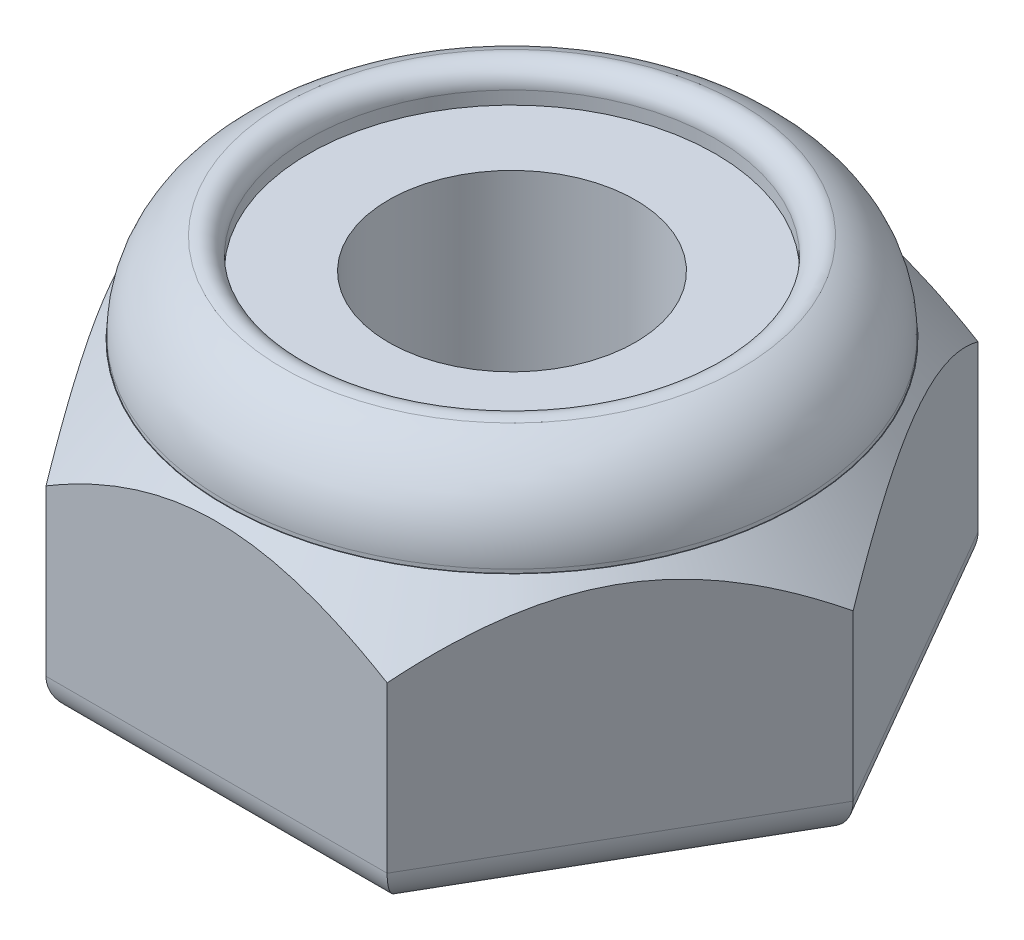
ISO-10303-21;
HEADER;
FILE_DESCRIPTION(('STEP AP214'),'2;1');
FILE_NAME('part.step','',(''),(''),'','','');
FILE_SCHEMA(('AUTOMOTIVE_DESIGN { 1 0 10303 214 1 1 1 1 }'));
ENDSEC;
DATA;
#1=APPLICATION_CONTEXT('core data for automotive mechanical design processes');
#2=APPLICATION_PROTOCOL_DEFINITION('international standard','automotive_design',2000,#1);
#3=PRODUCT_CONTEXT('',#1,'mechanical');
#4=PRODUCT('Part','Part','',(#3));
#5=PRODUCT_RELATED_PRODUCT_CATEGORY('part','',(#4));
#6=PRODUCT_DEFINITION_FORMATION('','',#4);
#7=PRODUCT_DEFINITION_CONTEXT('part definition',#1,'design');
#8=PRODUCT_DEFINITION('design','',#6,#7);
#9=PRODUCT_DEFINITION_SHAPE('','',#8);
#10=(LENGTH_UNIT() NAMED_UNIT(*) SI_UNIT(.MILLI.,.METRE.));
#11=(NAMED_UNIT(*) PLANE_ANGLE_UNIT() SI_UNIT($,.RADIAN.));
#12=(NAMED_UNIT(*) SI_UNIT($,.STERADIAN.) SOLID_ANGLE_UNIT());
#13=UNCERTAINTY_MEASURE_WITH_UNIT(LENGTH_MEASURE(1.E-05),#10,'distance_accuracy_value','');
#14=(GEOMETRIC_REPRESENTATION_CONTEXT(3) GLOBAL_UNCERTAINTY_ASSIGNED_CONTEXT((#13)) GLOBAL_UNIT_ASSIGNED_CONTEXT((#10,
#11,#12)) REPRESENTATION_CONTEXT('',''));
#15=CARTESIAN_POINT('',(0.,0.,0.));
#16=DIRECTION('',(0.,0.,1.));
#17=DIRECTION('',(1.,0.,0.));
#18=AXIS2_PLACEMENT_3D('',#15,#16,#17);
#19=CARTESIAN_POINT('',(0.,4.9784,0.));
#20=DIRECTION('',(0.,-1.,0.));
#21=DIRECTION('',(0.,0.,-1.));
#22=AXIS2_PLACEMENT_3D('',#19,#20,#21);
#23=CYLINDRICAL_SURFACE('',#22,3.937);
#24=CARTESIAN_POINT('',(0.,3.7084,0.));
#25=DIRECTION('',(0.,1.,0.));
#26=DIRECTION('',(0.,0.,1.));
#27=AXIS2_PLACEMENT_3D('',#24,#25,#26);
#28=CIRCLE('',#27,3.937);
#29=CARTESIAN_POINT('',(0.,3.7084,3.937));
#30=VERTEX_POINT('',#29);
#31=EDGE_CURVE('E244',#30,#30,#28,.T.);
#32=ORIENTED_EDGE('',*,*,#31,.F.);
#33=EDGE_LOOP('',(#32));
#34=FACE_BOUND('',#33,.T.);
#35=CARTESIAN_POINT('',(0.,3.6576,0.));
#36=DIRECTION('',(0.,-1.,0.));
#37=DIRECTION('',(0.,0.,-1.));
#38=AXIS2_PLACEMENT_3D('',#35,#36,#37);
#39=CIRCLE('',#38,3.937);
#40=CARTESIAN_POINT('',(0.,3.6576,-3.937));
#41=VERTEX_POINT('',#40);
#42=EDGE_CURVE('E20',#41,#41,#39,.F.);
#43=ORIENTED_EDGE('',*,*,#42,.T.);
#44=EDGE_LOOP('',(#43));
#45=FACE_BOUND('',#44,.T.);
#46=ADVANCED_FACE('F17',(#34,#45),#23,.T.);
#47=CARTESIAN_POINT('',(0.,3.7084,0.));
#48=DIRECTION('',(0.,1.,0.));
#49=DIRECTION('',(0.,0.,1.));
#50=AXIS2_PLACEMENT_3D('',#47,#48,#49);
#51=TOROIDAL_SURFACE('',#50,2.667,1.27);
#52=ORIENTED_EDGE('',*,*,#31,.T.);
#53=EDGE_LOOP('',(#52));
#54=FACE_BOUND('',#53,.T.);
#55=CARTESIAN_POINT('',(0.,4.88572150982644,0.));
#56=DIRECTION('',(0.,-1.,0.));
#57=DIRECTION('',(0.,0.,-1.));
#58=AXIS2_PLACEMENT_3D('',#55,#56,#57);
#59=CIRCLE('',#58,3.14325);
#60=CARTESIAN_POINT('',(0.,4.88572150982644,-3.14325));
#61=VERTEX_POINT('',#60);
#62=EDGE_CURVE('E238',#61,#61,#59,.F.);
#63=ORIENTED_EDGE('',*,*,#62,.F.);
#64=EDGE_LOOP('',(#63));
#65=FACE_BOUND('',#64,.T.);
#66=ADVANCED_FACE('F135',(#54,#65),#51,.T.);
#67=CARTESIAN_POINT('',(2.34315,3.6576,4.05845484975502));
#68=DIRECTION('',(0.,-1.,0.));
#69=DIRECTION('',(0.,0.,-1.));
#70=AXIS2_PLACEMENT_3D('',#67,#68,#69);
#71=PLANE('',#70);
#72=ORIENTED_EDGE('',*,*,#42,.F.);
#73=EDGE_LOOP('',(#72));
#74=FACE_BOUND('',#73,.T.);
#75=CARTESIAN_POINT('',(0.,3.65760000011051,0.));
#76=DIRECTION('',(0.,-1.,0.));
#77=DIRECTION('',(0.,0.,-1.));
#78=AXIS2_PLACEMENT_3D('',#75,#76,#77);
#79=CIRCLE('',#78,3.94407100938664);
#80=CARTESIAN_POINT('',(0.,3.65760000011051,-3.94407100938664));
#81=VERTEX_POINT('',#80);
#82=EDGE_CURVE('E120',#81,#81,#79,.T.);
#83=ORIENTED_EDGE('',*,*,#82,.F.);
#84=EDGE_LOOP('',(#83));
#85=FACE_BOUND('',#84,.T.);
#86=ADVANCED_FACE('F130',(#74,#85),#71,.F.);
#87=CARTESIAN_POINT('',(0.,4.65025720786115,0.));
#88=DIRECTION('',(0.,-1.,0.));
#89=DIRECTION('',(0.,0.,-1.));
#90=AXIS2_PLACEMENT_3D('',#87,#88,#89);
#91=TOROIDAL_SURFACE('',#90,3.048,0.254);
#92=CARTESIAN_POINT('',(0.,4.65025720786115,0.));
#93=DIRECTION('',(0.,1.,0.));
#94=DIRECTION('',(0.,0.,1.));
#95=AXIS2_PLACEMENT_3D('',#92,#93,#94);
#96=CIRCLE('',#95,2.794);
#97=CARTESIAN_POINT('',(0.,4.65025720786115,2.794));
#98=VERTEX_POINT('',#97);
#99=EDGE_CURVE('E105',#98,#98,#96,.F.);
#100=ORIENTED_EDGE('',*,*,#99,.T.);
#101=EDGE_LOOP('',(#100));
#102=FACE_BOUND('',#101,.T.);
#103=ORIENTED_EDGE('',*,*,#62,.T.);
#104=EDGE_LOOP('',(#103));
#105=FACE_BOUND('',#104,.T.);
#106=ADVANCED_FACE('F126',(#102,#105),#91,.T.);
#107=CARTESIAN_POINT('',(0.,2.76773860969115,0.));
#108=DIRECTION('',(0.,-1.,0.));
#109=DIRECTION('',(0.,0.,-1.));
#110=AXIS2_PLACEMENT_3D('',#107,#108,#109);
#111=CONICAL_SURFACE('',#110,4.69075337389313,0.698131700802158);
#112=CARTESIAN_POINT('',(-4.68630000001476,2.77304593398821,-5.33338044389321E-11));
#113=CARTESIAN_POINT('',(-4.65177717141793,2.81418235889091,0.0597952931149053));
#114=CARTESIAN_POINT('',(-4.61695780288956,2.85432113110728,0.120104208500933));
#115=CARTESIAN_POINT('',(-4.54666264441453,2.93230661020916,0.241858994511412));
#116=CARTESIAN_POINT('',(-4.51118655194523,2.97015222462005,0.303305389120424));
#117=CARTESIAN_POINT('',(-4.40329561885259,3.08018701500149,0.490177966909937));
#118=CARTESIAN_POINT('',(-4.32983334004397,3.14837015576205,0.617418366247689));
#119=CARTESIAN_POINT('',(-4.1797796499728,3.27092778609509,0.877318981315214));
#120=CARTESIAN_POINT('',(-4.10317943932402,3.32525984886677,1.00999443802899));
#121=CARTESIAN_POINT('',(-3.94747591651277,3.41577217646148,1.27968085045525));
#122=CARTESIAN_POINT('',(-3.86837998243724,3.45200143013375,1.4166790269463));
#123=CARTESIAN_POINT('',(-3.73746585196202,3.49372811243502,1.64342895235813));
#124=CARTESIAN_POINT('',(-3.68614686019516,3.50560413715319,1.73231605349153));
#125=CARTESIAN_POINT('',(-3.58316406708587,3.52008140702852,1.91068748346216));
#126=CARTESIAN_POINT('',(-3.53150020834088,3.5226810675312,2.00017191172355));
#127=CARTESIAN_POINT('',(-3.42855034551142,3.51847006524789,2.17848630477643));
#128=CARTESIAN_POINT('',(-3.3772638088531,3.51171021118306,2.26731719201287));
#129=CARTESIAN_POINT('',(-3.27519197708947,3.48921023555424,2.4441107906491));
#130=CARTESIAN_POINT('',(-3.22440670715057,3.4734696654174,2.53207345845939));
#131=CARTESIAN_POINT('',(-3.10963060134479,3.42817062222156,2.73087150520989));
#132=CARTESIAN_POINT('',(-3.04589899577138,3.39598542076133,2.84125788411099));
#133=CARTESIAN_POINT('',(-2.92018166739655,3.32004827846255,3.05900668424801));
#134=CARTESIAN_POINT('',(-2.85819691962206,3.27629001415058,3.16636741668776));
#135=CARTESIAN_POINT('',(-2.735889068299,3.17910361386979,3.37821082934389));
#136=CARTESIAN_POINT('',(-2.67557364738244,3.12563730731956,3.48268020285126));
#137=CARTESIAN_POINT('',(-2.55683004320588,3.01104764609313,3.68835015835892));
#138=CARTESIAN_POINT('',(-2.49840123089761,2.94992687749399,3.78955182990274));
#139=CARTESIAN_POINT('',(-2.42439626092569,2.86741854625153,3.91773219790672));
#140=CARTESIAN_POINT('',(-2.40802320106583,2.84883596648691,3.94609116945937));
#141=CARTESIAN_POINT('',(-2.3754621576302,2.81125673907332,4.00248855103733));
#142=CARTESIAN_POINT('',(-2.35927376441604,2.79226151161516,4.03052767057717));
#143=CARTESIAN_POINT('',(-2.3431499999717,2.77304593399368,4.05845484980404));
#144=B_SPLINE_CURVE_WITH_KNOTS('',3,(#112,#113,#114,#115,#116,#117,#118,#119,#120,#121,#122,
#123,#124,#125,#126,#127,#128,#129,#130,#131,#132,#133,#134,#135,#136,#137,#138,#139,#140,#141,
#142,#143),.UNSPECIFIED.,.F.,.F.,(4,2,2,2,2,2,2,2,2,2,2,2,2,2,2,4),(0.,0.241096809088565,
0.48230758945251,0.967637153847366,1.45443592242802,1.93991010956963,2.24950193433618,
2.55914664324831,2.86711700071403,3.17510274216898,3.56882084711336,3.96275452403261,
4.35827201930639,4.75365624679115,4.86660838982692,4.97921936905084),.UNSPECIFIED.);
#145=CARTESIAN_POINT('',(-4.68630000002839,2.77304593399358,0.));
#146=VERTEX_POINT('',#145);
#147=CARTESIAN_POINT('',(-2.34315000001419,2.77304593399358,4.05845484977959));
#148=VERTEX_POINT('',#147);
#149=EDGE_CURVE('E92',#146,#148,#144,.T.);
#150=ORIENTED_EDGE('',*,*,#149,.T.);
#151=CARTESIAN_POINT('',(-2.34315000005357,2.77304593398822,4.05845484974113));
#152=CARTESIAN_POINT('',(-2.27415972170409,2.81414935271336,4.05845484974989));
#153=CARTESIAN_POINT('',(-2.20457738522044,2.85425669884705,4.05845484975361));
#154=CARTESIAN_POINT('',(-2.06410193528095,2.93218331968194,4.05845484975642));
#155=CARTESIAN_POINT('',(-1.99320821641151,2.9700015013142,4.05845484975551));
#156=CARTESIAN_POINT('',(-1.77754688772429,3.07999086386455,4.05845484975401));
#157=CARTESIAN_POINT('',(-1.63068545869954,3.1481589403704,4.05845484975469));
#158=CARTESIAN_POINT('',(-1.33052752457963,3.27077676919262,4.05845484975534));
#159=CARTESIAN_POINT('',(-1.17720631609342,3.32516696804196,4.0584548497553));
#160=CARTESIAN_POINT('',(-0.86561350380778,3.41574608766059,4.05845484975473));
#161=CARTESIAN_POINT('',(-0.707359229311903,3.45199244874899,4.0584548497542));
#162=CARTESIAN_POINT('',(-0.456822143345071,3.49192146546895,4.05845484975548));
#163=CARTESIAN_POINT('',(-0.365672921156202,3.50290887295604,4.05845484975637));
#164=CARTESIAN_POINT('',(-0.183016322004482,3.51758027913678,4.05845484975366));
#165=CARTESIAN_POINT('',(-0.0915105175250816,3.52128341037061,4.05845484975007));
#166=CARTESIAN_POINT('',(0.104649468641441,3.52128177491765,4.0584548497495));
#167=CARTESIAN_POINT('',(0.209305100872023,3.51643705333648,4.05845484975354));
#168=CARTESIAN_POINT('',(0.41778718190987,3.49730239560235,4.05845484975649));
#169=CARTESIAN_POINT('',(0.521613181352877,3.48300765111694,4.05845484975541));
#170=CARTESIAN_POINT('',(0.728332544913561,3.44553375886282,4.05845484975462));
#171=CARTESIAN_POINT('',(0.831215331558566,3.42229697724238,4.05845484975491));
#172=CARTESIAN_POINT('',(1.03487580391125,3.36791830054733,4.05845484975512));
#173=CARTESIAN_POINT('',(1.13565289468809,3.33677420321768,4.05845484975504));
#174=CARTESIAN_POINT('',(1.33273383822163,3.26838741918099,4.05845484975499));
#175=CARTESIAN_POINT('',(1.42908716226035,3.23128582684656,4.05845484975501));
#176=CARTESIAN_POINT('',(1.61947291708309,3.15151071591982,4.05845484975502));
#177=CARTESIAN_POINT('',(1.71350470709807,3.10883567899407,4.05845484975502));
#178=CARTESIAN_POINT('',(1.89803195382395,3.01941532331662,4.05845484975501));
#179=CARTESIAN_POINT('',(1.98855798046432,2.97273255726059,4.05845484975502));
#180=CARTESIAN_POINT('',(2.16742834958163,2.87556944084479,4.05845484975502));
#181=CARTESIAN_POINT('',(2.25577492892455,2.82509321932285,4.05845484975502));
#182=CARTESIAN_POINT('',(2.34315000005566,2.77304593399424,4.05845484975502));
#183=B_SPLINE_CURVE_WITH_KNOTS('',3,(#151,#152,#153,#154,#155,#156,#157,#158,#159,#160,#161,
#162,#163,#164,#165,#166,#167,#168,#169,#170,#171,#172,#173,#174,#175,#176,#177,#178,#179,#180,
#181,#182),.UNSPECIFIED.,.F.,.F.,(4,2,2,2,2,2,2,2,2,2,2,2,2,2,2,4),(0.,0.24090330355952,
0.481920744736242,0.967059466968447,1.4542606837498,1.93990959177134,2.21507934695766,
2.4895253838939,2.80337599596431,3.11738642360393,3.43345557972405,3.74961286055439,
4.0591611810716,4.36879400620232,4.67425708545866,4.97939238068026),.UNSPECIFIED.);
#184=CARTESIAN_POINT('',(2.34315000001419,2.77304593399358,4.05845484977959));
#185=VERTEX_POINT('',#184);
#186=EDGE_CURVE('E84',#148,#185,#183,.T.);
#187=ORIENTED_EDGE('',*,*,#186,.T.);
#188=CARTESIAN_POINT('',(2.3431499999612,2.77304593398822,4.05845484979446));
#189=CARTESIAN_POINT('',(2.37767282857321,2.81418235889091,3.99865955663499));
#190=CARTESIAN_POINT('',(2.41249219710801,2.85432113110729,3.93835064125267));
#191=CARTESIAN_POINT('',(2.48278735558791,2.93230661020917,3.816595855245));
#192=CARTESIAN_POINT('',(2.51826344805563,2.97015222462005,3.75514946063508));
#193=CARTESIAN_POINT('',(2.62615438114571,3.0801870150015,3.56827688284408));
#194=CARTESIAN_POINT('',(2.69961665995557,3.14837015576206,3.44103648350706));
#195=CARTESIAN_POINT('',(2.84967035002766,3.2709277860951,3.18113586844006));
#196=CARTESIAN_POINT('',(2.9262705606761,3.32525984886677,3.04846041172609));
#197=CARTESIAN_POINT('',(3.08197408348711,3.41577217646148,2.77877399929969));
#198=CARTESIAN_POINT('',(3.16107001756274,3.45200143013376,2.64177582280869));
#199=CARTESIAN_POINT('',(3.291984148038,3.49372811243503,2.41502589739689));
#200=CARTESIAN_POINT('',(3.34330313980485,3.50560413715319,2.32613879626348));
#201=CARTESIAN_POINT('',(3.44628593291413,3.52008140702853,2.14776736629285));
#202=CARTESIAN_POINT('',(3.49794979165912,3.52268106753121,2.05828293803146));
#203=CARTESIAN_POINT('',(3.60089965448859,3.51847006524789,1.87996854497858));
#204=CARTESIAN_POINT('',(3.6521861911469,3.51171021118306,1.79113765774214));
#205=CARTESIAN_POINT('',(3.75425802291053,3.48921023555425,1.61434405910591));
#206=CARTESIAN_POINT('',(3.80504329284943,3.47346966541741,1.52638139129562));
#207=CARTESIAN_POINT('',(3.91981939865521,3.42817062222156,1.32758334454512));
#208=CARTESIAN_POINT('',(3.98355100422862,3.39598542076133,1.21719696564402));
#209=CARTESIAN_POINT('',(4.10926833260345,3.32004827846255,0.999448165506998));
#210=CARTESIAN_POINT('',(4.17125308037794,3.27629001415058,0.892087433067249));
#211=CARTESIAN_POINT('',(4.293560931701,3.17910361386979,0.680244020411123));
#212=CARTESIAN_POINT('',(4.35387635261756,3.12563730731956,0.575774646903748));
#213=CARTESIAN_POINT('',(4.47261995679412,3.01104764609313,0.370104691396085));
#214=CARTESIAN_POINT('',(4.53104876910239,2.94992687749399,0.268903019852267));
#215=CARTESIAN_POINT('',(4.60505373907431,2.86741854625153,0.140722651848287));
#216=CARTESIAN_POINT('',(4.62142679893417,2.84883596648691,0.112363680295637));
#217=CARTESIAN_POINT('',(4.6539878423698,2.81125673907332,0.0559662987176779));
#218=CARTESIAN_POINT('',(4.67017623558396,2.79226151161516,0.0279271791778418));
#219=CARTESIAN_POINT('',(4.6863000000283,2.77304593399368,-4.90270010654762E-11));
#220=B_SPLINE_CURVE_WITH_KNOTS('',3,(#188,#189,#190,#191,#192,#193,#194,#195,#196,#197,#198,
#199,#200,#201,#202,#203,#204,#205,#206,#207,#208,#209,#210,#211,#212,#213,#214,#215,#216,#217,
#218,#219),.UNSPECIFIED.,.F.,.F.,(4,2,2,2,2,2,2,2,2,2,2,2,2,2,2,4),(0.,0.241096809088565,
0.48230758945251,0.967637153847364,1.45443592242802,1.93991010956962,2.24950193433617,
2.5591466432483,2.86711700071402,3.17510274216897,3.56882084711336,3.9627545240326,
4.35827201930639,4.75365624679114,4.86660838982692,4.97921936905084),.UNSPECIFIED.);
#221=CARTESIAN_POINT('',(4.68630000001419,2.7730459340105,-2.45819040202403E-11));
#222=VERTEX_POINT('',#221);
#223=EDGE_CURVE('E89',#185,#222,#220,.T.);
#224=ORIENTED_EDGE('',*,*,#223,.T.);
#225=CARTESIAN_POINT('',(4.68630000001476,2.77304593398822,5.33267015141622E-11));
#226=CARTESIAN_POINT('',(4.65177717141792,2.81418235889091,-0.0597952931149122));
#227=CARTESIAN_POINT('',(4.61695780288956,2.85432113110729,-0.12010420850094));
#228=CARTESIAN_POINT('',(4.54666264441452,2.93230661020917,-0.241858994511418));
#229=CARTESIAN_POINT('',(4.51118655194522,2.97015222462005,-0.303305389120429));
#230=CARTESIAN_POINT('',(4.40329561885258,3.0801870150015,-0.490177966909942));
#231=CARTESIAN_POINT('',(4.32983334004397,3.14837015576206,-0.617418366247693));
#232=CARTESIAN_POINT('',(4.1797796499728,3.27092778609509,-0.877318981315217));
#233=CARTESIAN_POINT('',(4.10317943932402,3.32525984886677,-1.00999443802899));
#234=CARTESIAN_POINT('',(3.94747591651277,3.41577217646148,-1.27968085045525));
#235=CARTESIAN_POINT('',(3.86837998243724,3.45200143013375,-1.4166790269463));
#236=CARTESIAN_POINT('',(3.73746585196202,3.49372811243502,-1.64342895235813));
#237=CARTESIAN_POINT('',(3.68614686019516,3.50560413715319,-1.73231605349153));
#238=CARTESIAN_POINT('',(3.58316406708587,3.52008140702852,-1.91068748346216));
#239=CARTESIAN_POINT('',(3.53150020834088,3.5226810675312,-2.00017191172355));
#240=CARTESIAN_POINT('',(3.42855034551142,3.51847006524789,-2.17848630477643));
#241=CARTESIAN_POINT('',(3.3772638088531,3.51171021118306,-2.26731719201287));
#242=CARTESIAN_POINT('',(3.27519197708947,3.48921023555424,-2.4441107906491));
#243=CARTESIAN_POINT('',(3.22440670715057,3.4734696654174,-2.53207345845939));
#244=CARTESIAN_POINT('',(3.10963060134479,3.42817062222156,-2.73087150520989));
#245=CARTESIAN_POINT('',(3.04589899577138,3.39598542076133,-2.84125788411098));
#246=CARTESIAN_POINT('',(2.92018166739655,3.32004827846255,-3.05900668424801));
#247=CARTESIAN_POINT('',(2.85819691962206,3.27629001415058,-3.16636741668776));
#248=CARTESIAN_POINT('',(2.735889068299,3.17910361386979,-3.37821082934388));
#249=CARTESIAN_POINT('',(2.67557364738245,3.12563730731956,-3.48268020285126));
#250=CARTESIAN_POINT('',(2.55683004320588,3.01104764609313,-3.68835015835892));
#251=CARTESIAN_POINT('',(2.49840123089761,2.94992687749399,-3.78955182990274));
#252=CARTESIAN_POINT('',(2.42439626092569,2.86741854625153,-3.91773219790672));
#253=CARTESIAN_POINT('',(2.40802320106583,2.84883596648691,-3.94609116945937));
#254=CARTESIAN_POINT('',(2.3754621576302,2.81125673907332,-4.00248855103733));
#255=CARTESIAN_POINT('',(2.35927376441604,2.79226151161516,-4.03052767057717));
#256=CARTESIAN_POINT('',(2.3431499999717,2.77304593399368,-4.05845484980404));
#257=B_SPLINE_CURVE_WITH_KNOTS('',3,(#225,#226,#227,#228,#229,#230,#231,#232,#233,#234,#235,
#236,#237,#238,#239,#240,#241,#242,#243,#244,#245,#246,#247,#248,#249,#250,#251,#252,#253,#254,
#255,#256),.UNSPECIFIED.,.F.,.F.,(4,2,2,2,2,2,2,2,2,2,2,2,2,2,2,4),(0.,0.241096809088563,
0.482307589452507,0.967637153847359,1.45443592242801,1.93991010956962,2.24950193433616,
2.55914664324829,2.86711700071401,3.17510274216897,3.56882084711335,3.96275452403259,
4.35827201930638,4.75365624679114,4.86660838982692,4.97921936905084),.UNSPECIFIED.);
#258=CARTESIAN_POINT('',(2.34315000001419,2.77304593399358,-4.0584548497796));
#259=VERTEX_POINT('',#258);
#260=EDGE_CURVE('E194',#222,#259,#257,.T.);
#261=ORIENTED_EDGE('',*,*,#260,.T.);
#262=CARTESIAN_POINT('',(2.34315000005357,2.77304593398821,-4.05845484974114));
#263=CARTESIAN_POINT('',(2.27415972170409,2.81414935271335,-4.05845484974989));
#264=CARTESIAN_POINT('',(2.20457738522045,2.85425669884704,-4.05845484975361));
#265=CARTESIAN_POINT('',(2.06410193528096,2.93218331968193,-4.05845484975643));
#266=CARTESIAN_POINT('',(1.99320821641151,2.97000150131419,-4.05845484975552));
#267=CARTESIAN_POINT('',(1.77754688772429,3.07999086386454,-4.05845484975402));
#268=CARTESIAN_POINT('',(1.63068545869954,3.1481589403704,-4.0584548497547));
#269=CARTESIAN_POINT('',(1.33052752457963,3.27077676919261,-4.05845484975534));
#270=CARTESIAN_POINT('',(1.17720631609342,3.32516696804195,-4.0584548497553));
#271=CARTESIAN_POINT('',(0.865613503807778,3.41574608766058,-4.05845484975474));
#272=CARTESIAN_POINT('',(0.707359229311901,3.45199244874898,-4.0584548497542));
#273=CARTESIAN_POINT('',(0.456822143345069,3.49192146546895,-4.05845484975548));
#274=CARTESIAN_POINT('',(0.365672921156201,3.50290887295604,-4.05845484975637));
#275=CARTESIAN_POINT('',(0.183016322004481,3.51758027913677,-4.05845484975367));
#276=CARTESIAN_POINT('',(0.0915105175250814,3.5212834103706,-4.05845484975008));
#277=CARTESIAN_POINT('',(-0.104649468641441,3.52128177491764,-4.0584548497495));
#278=CARTESIAN_POINT('',(-0.209305100872023,3.51643705333648,-4.05845484975354));
#279=CARTESIAN_POINT('',(-0.41778718190987,3.49730239560234,-4.0584548497565));
#280=CARTESIAN_POINT('',(-0.521613181352877,3.48300765111693,-4.05845484975542));
#281=CARTESIAN_POINT('',(-0.728332544913562,3.44553375886281,-4.05845484975462));
#282=CARTESIAN_POINT('',(-0.831215331558566,3.42229697724237,-4.05845484975491));
#283=CARTESIAN_POINT('',(-1.03487580391125,3.36791830054732,-4.05845484975513));
#284=CARTESIAN_POINT('',(-1.13565289468809,3.33677420321767,-4.05845484975505));
#285=CARTESIAN_POINT('',(-1.33273383822163,3.26838741918098,-4.05845484975499));
#286=CARTESIAN_POINT('',(-1.42908716226035,3.23128582684655,-4.05845484975501));
#287=CARTESIAN_POINT('',(-1.61947291708309,3.15151071591982,-4.05845484975503));
#288=CARTESIAN_POINT('',(-1.71350470709807,3.10883567899406,-4.05845484975502));
#289=CARTESIAN_POINT('',(-1.89803195382395,3.01941532331662,-4.05845484975502));
#290=CARTESIAN_POINT('',(-1.98855798046431,2.97273255726059,-4.05845484975502));
#291=CARTESIAN_POINT('',(-2.16742834958162,2.87556944084479,-4.05845484975502));
#292=CARTESIAN_POINT('',(-2.25577492892455,2.82509321932284,-4.05845484975502));
#293=CARTESIAN_POINT('',(-2.34315000005566,2.77304593399424,-4.05845484975502));
#294=B_SPLINE_CURVE_WITH_KNOTS('',3,(#262,#263,#264,#265,#266,#267,#268,#269,#270,#271,#272,
#273,#274,#275,#276,#277,#278,#279,#280,#281,#282,#283,#284,#285,#286,#287,#288,#289,#290,#291,
#292,#293),.UNSPECIFIED.,.F.,.F.,(4,2,2,2,2,2,2,2,2,2,2,2,2,2,2,4),(0.,0.24090330355952,
0.481920744736243,0.96705946696845,1.4542606837498,1.93990959177135,2.21507934695766,
2.48952538389391,2.80337599596432,3.11738642360394,3.43345557972405,3.74961286055439,
4.0591611810716,4.36879400620232,4.67425708545866,4.97939238068026),.UNSPECIFIED.);
#295=CARTESIAN_POINT('',(-2.34315000001419,2.77304593399358,-4.0584548497796));
#296=VERTEX_POINT('',#295);
#297=EDGE_CURVE('E204',#259,#296,#294,.T.);
#298=ORIENTED_EDGE('',*,*,#297,.T.);
#299=CARTESIAN_POINT('',(-2.3431499999612,2.77304593398821,-4.05845484979447));
#300=CARTESIAN_POINT('',(-2.37767282857321,2.81418235889091,-3.99865955663499));
#301=CARTESIAN_POINT('',(-2.41249219710802,2.85432113110728,-3.93835064125268));
#302=CARTESIAN_POINT('',(-2.48278735558791,2.93230661020916,-3.81659585524501));
#303=CARTESIAN_POINT('',(-2.51826344805563,2.97015222462005,-3.75514946063508));
#304=CARTESIAN_POINT('',(-2.62615438114571,3.08018701500149,-3.56827688284409));
#305=CARTESIAN_POINT('',(-2.69961665995557,3.14837015576205,-3.44103648350706));
#306=CARTESIAN_POINT('',(-2.84967035002766,3.27092778609509,-3.18113586844007));
#307=CARTESIAN_POINT('',(-2.9262705606761,3.32525984886676,-3.0484604117261));
#308=CARTESIAN_POINT('',(-3.08197408348711,3.41577217646147,-2.7787739992997));
#309=CARTESIAN_POINT('',(-3.16107001756274,3.45200143013375,-2.6417758228087));
#310=CARTESIAN_POINT('',(-3.291984148038,3.49372811243502,-2.4150258973969));
#311=CARTESIAN_POINT('',(-3.34330313980485,3.50560413715318,-2.32613879626349));
#312=CARTESIAN_POINT('',(-3.44628593291413,3.52008140702852,-2.14776736629286));
#313=CARTESIAN_POINT('',(-3.49794979165912,3.5226810675312,-2.05828293803147));
#314=CARTESIAN_POINT('',(-3.60089965448859,3.51847006524788,-1.87996854497859));
#315=CARTESIAN_POINT('',(-3.6521861911469,3.51171021118305,-1.79113765774215));
#316=CARTESIAN_POINT('',(-3.75425802291053,3.48921023555424,-1.61434405910592));
#317=CARTESIAN_POINT('',(-3.80504329284944,3.4734696654174,-1.52638139129563));
#318=CARTESIAN_POINT('',(-3.91981939865521,3.42817062222155,-1.32758334454513));
#319=CARTESIAN_POINT('',(-3.98355100422863,3.39598542076132,-1.21719696564403));
#320=CARTESIAN_POINT('',(-4.10926833260346,3.32004827846254,-0.999448165507007));
#321=CARTESIAN_POINT('',(-4.17125308037794,3.27629001415057,-0.892087433067259));
#322=CARTESIAN_POINT('',(-4.29356093170101,3.17910361386978,-0.680244020411133));
#323=CARTESIAN_POINT('',(-4.35387635261756,3.12563730731955,-0.575774646903757));
#324=CARTESIAN_POINT('',(-4.47261995679413,3.01104764609312,-0.370104691396094));
#325=CARTESIAN_POINT('',(-4.53104876910239,2.94992687749399,-0.268903019852276));
#326=CARTESIAN_POINT('',(-4.60505373907432,2.86741854625152,-0.140722651848295));
#327=CARTESIAN_POINT('',(-4.62142679893418,2.84883596648691,-0.112363680295645));
#328=CARTESIAN_POINT('',(-4.6539878423698,2.81125673907331,-0.0559662987176854));
#329=CARTESIAN_POINT('',(-4.67017623558397,2.79226151161515,-0.0279271791778493));
#330=CARTESIAN_POINT('',(-4.68630000002831,2.77304593399367,4.90195592876359E-11));
#331=B_SPLINE_CURVE_WITH_KNOTS('',3,(#299,#300,#301,#302,#303,#304,#305,#306,#307,#308,#309,
#310,#311,#312,#313,#314,#315,#316,#317,#318,#319,#320,#321,#322,#323,#324,#325,#326,#327,#328,
#329,#330),.UNSPECIFIED.,.F.,.F.,(4,2,2,2,2,2,2,2,2,2,2,2,2,2,2,4),(0.,0.241096809088565,
0.482307589452509,0.967637153847361,1.45443592242802,1.93991010956962,2.24950193433617,
2.5591466432483,2.86711700071402,3.17510274216897,3.56882084711335,3.9627545240326,
4.35827201930639,4.75365624679114,4.86660838982692,4.97921936905084),.UNSPECIFIED.);
#332=EDGE_CURVE('E210',#296,#146,#331,.T.);
#333=ORIENTED_EDGE('',*,*,#332,.T.);
#334=EDGE_LOOP('',(#150,#187,#224,#261,#298,#333));
#335=FACE_BOUND('',#334,.T.);
#336=ORIENTED_EDGE('',*,*,#82,.T.);
#337=EDGE_LOOP('',(#336));
#338=FACE_BOUND('',#337,.T.);
#339=ADVANCED_FACE('F86',(#335,#338),#111,.T.);
#340=CARTESIAN_POINT('',(0.,4.4704,0.));
#341=DIRECTION('',(0.,1.,0.));
#342=DIRECTION('',(0.,0.,1.));
#343=AXIS2_PLACEMENT_3D('',#340,#341,#342);
#344=CYLINDRICAL_SURFACE('',#343,2.794);
#345=ORIENTED_EDGE('',*,*,#99,.F.);
#346=EDGE_LOOP('',(#345));
#347=FACE_BOUND('',#346,.T.);
#348=CARTESIAN_POINT('',(0.,4.4704,0.));
#349=DIRECTION('',(0.,1.,0.));
#350=DIRECTION('',(0.,0.,1.));
#351=AXIS2_PLACEMENT_3D('',#348,#349,#350);
#352=CIRCLE('',#351,2.794);
#353=CARTESIAN_POINT('',(0.,4.4704,2.794));
#354=VERTEX_POINT('',#353);
#355=EDGE_CURVE('E202',#354,#354,#352,.T.);
#356=ORIENTED_EDGE('',*,*,#355,.F.);
#357=EDGE_LOOP('',(#356));
#358=FACE_BOUND('',#357,.T.);
#359=ADVANCED_FACE('F376',(#347,#358),#344,.F.);
#360=CARTESIAN_POINT('',(2.34315,3.6576,4.05845484975502));
#361=DIRECTION('',(-0.866025403784439,0.,-0.499999999999999));
#362=DIRECTION('',(-0.499999999999999,0.,0.866025403784439));
#363=AXIS2_PLACEMENT_3D('',#360,#361,#362);
#364=PLANE('',#363);
#365=DIRECTION('',(-0.499999999999999,0.,0.866025403784439));
#366=VECTOR('',#365,1.);
#367=CARTESIAN_POINT('',(2.34315,0.508,4.05845484975502));
#368=LINE('',#367,#366);
#369=CARTESIAN_POINT('',(4.6863,0.508,0.));
#370=VERTEX_POINT('',#369);
#371=CARTESIAN_POINT('',(2.34315000000001,0.508,4.05845484975502));
#372=VERTEX_POINT('',#371);
#373=EDGE_CURVE('E268',#370,#372,#368,.T.);
#374=ORIENTED_EDGE('',*,*,#373,.F.);
#375=DIRECTION('',(0.,1.,0.));
#376=VECTOR('',#375,1.);
#377=CARTESIAN_POINT('',(4.6863,3.6576,0.));
#378=LINE('',#377,#376);
#379=EDGE_CURVE('E103',#370,#222,#378,.T.);
#380=ORIENTED_EDGE('',*,*,#379,.T.);
#381=ORIENTED_EDGE('',*,*,#223,.F.);
#382=DIRECTION('',(0.,1.,0.));
#383=VECTOR('',#382,1.);
#384=CARTESIAN_POINT('',(2.34315000000001,3.6576,4.05845484975502));
#385=LINE('',#384,#383);
#386=EDGE_CURVE('E96',#185,#372,#385,.F.);
#387=ORIENTED_EDGE('',*,*,#386,.T.);
#388=EDGE_LOOP('',(#374,#380,#381,#387));
#389=FACE_BOUND('',#388,.T.);
#390=ADVANCED_FACE('F100',(#389),#364,.F.);
#391=CARTESIAN_POINT('',(-2.34315,3.6576,4.05845484975501));
#392=DIRECTION('',(0.,0.,-1.));
#393=DIRECTION('',(-1.,0.,0.));
#394=AXIS2_PLACEMENT_3D('',#391,#392,#393);
#395=PLANE('',#394);
#396=DIRECTION('',(-1.,0.,0.));
#397=VECTOR('',#396,1.);
#398=CARTESIAN_POINT('',(-2.34315,0.508,4.05845484975501));
#399=LINE('',#398,#397);
#400=CARTESIAN_POINT('',(-2.34315,0.508,4.05845484975501));
#401=VERTEX_POINT('',#400);
#402=EDGE_CURVE('E110',#372,#401,#399,.T.);
#403=ORIENTED_EDGE('',*,*,#402,.F.);
#404=ORIENTED_EDGE('',*,*,#386,.F.);
#405=ORIENTED_EDGE('',*,*,#186,.F.);
#406=DIRECTION('',(0.,1.,0.));
#407=VECTOR('',#406,1.);
#408=CARTESIAN_POINT('',(-2.34315,3.6576,4.05845484975501));
#409=LINE('',#408,#407);
#410=EDGE_CURVE('E113',#148,#401,#409,.F.);
#411=ORIENTED_EDGE('',*,*,#410,.T.);
#412=EDGE_LOOP('',(#403,#404,#405,#411));
#413=FACE_BOUND('',#412,.T.);
#414=ADVANCED_FACE('F108',(#413),#395,.F.);
#415=CARTESIAN_POINT('',(-4.6863,3.6576,0.));
#416=DIRECTION('',(0.866025403784439,0.,-0.5));
#417=DIRECTION('',(-0.5,0.,-0.866025403784439));
#418=AXIS2_PLACEMENT_3D('',#415,#416,#417);
#419=PLANE('',#418);
#420=DIRECTION('',(-0.5,0.,-0.866025403784439));
#421=VECTOR('',#420,1.);
#422=CARTESIAN_POINT('',(-4.6863,0.508,0.));
#423=LINE('',#422,#421);
#424=CARTESIAN_POINT('',(-4.68630000000001,0.508,0.));
#425=VERTEX_POINT('',#424);
#426=EDGE_CURVE('E264',#401,#425,#423,.T.);
#427=ORIENTED_EDGE('',*,*,#426,.F.);
#428=ORIENTED_EDGE('',*,*,#410,.F.);
#429=ORIENTED_EDGE('',*,*,#149,.F.);
#430=DIRECTION('',(0.,1.,0.));
#431=VECTOR('',#430,1.);
#432=CARTESIAN_POINT('',(-4.68630000000001,3.6576,0.));
#433=LINE('',#432,#431);
#434=EDGE_CURVE('E209',#146,#425,#433,.F.);
#435=ORIENTED_EDGE('',*,*,#434,.T.);
#436=EDGE_LOOP('',(#427,#428,#429,#435));
#437=FACE_BOUND('',#436,.T.);
#438=ADVANCED_FACE('F221',(#437),#419,.F.);
#439=CARTESIAN_POINT('',(-2.34315,3.6576,-4.05845484975502));
#440=DIRECTION('',(0.866025403784438,0.,0.5));
#441=DIRECTION('',(0.5,0.,-0.866025403784438));
#442=AXIS2_PLACEMENT_3D('',#439,#440,#441);
#443=PLANE('',#442);
#444=DIRECTION('',(0.5,0.,-0.866025403784438));
#445=VECTOR('',#444,1.);
#446=CARTESIAN_POINT('',(-2.34315,0.508,-4.05845484975502));
#447=LINE('',#446,#445);
#448=CARTESIAN_POINT('',(-2.34315,0.508,-4.05845484975502));
#449=VERTEX_POINT('',#448);
#450=EDGE_CURVE('E260',#425,#449,#447,.T.);
#451=ORIENTED_EDGE('',*,*,#450,.F.);
#452=ORIENTED_EDGE('',*,*,#434,.F.);
#453=ORIENTED_EDGE('',*,*,#332,.F.);
#454=DIRECTION('',(0.,1.,0.));
#455=VECTOR('',#454,1.);
#456=CARTESIAN_POINT('',(-2.34315,3.6576,-4.05845484975502));
#457=LINE('',#456,#455);
#458=EDGE_CURVE('E201',#296,#449,#457,.F.);
#459=ORIENTED_EDGE('',*,*,#458,.T.);
#460=EDGE_LOOP('',(#451,#452,#453,#459));
#461=FACE_BOUND('',#460,.T.);
#462=ADVANCED_FACE('F218',(#461),#443,.F.);
#463=CARTESIAN_POINT('',(2.34315,3.6576,-4.05845484975502));
#464=DIRECTION('',(0.,0.,1.));
#465=DIRECTION('',(1.,0.,0.));
#466=AXIS2_PLACEMENT_3D('',#463,#464,#465);
#467=PLANE('',#466);
#468=DIRECTION('',(1.,0.,0.));
#469=VECTOR('',#468,1.);
#470=CARTESIAN_POINT('',(2.34315,0.508,-4.05845484975502));
#471=LINE('',#470,#469);
#472=CARTESIAN_POINT('',(2.34315,0.508,-4.05845484975502));
#473=VERTEX_POINT('',#472);
#474=EDGE_CURVE('E256',#449,#473,#471,.T.);
#475=ORIENTED_EDGE('',*,*,#474,.F.);
#476=ORIENTED_EDGE('',*,*,#458,.F.);
#477=ORIENTED_EDGE('',*,*,#297,.F.);
#478=DIRECTION('',(0.,1.,0.));
#479=VECTOR('',#478,1.);
#480=CARTESIAN_POINT('',(2.34315,3.6576,-4.05845484975501));
#481=LINE('',#480,#479);
#482=EDGE_CURVE('E200',#259,#473,#481,.F.);
#483=ORIENTED_EDGE('',*,*,#482,.T.);
#484=EDGE_LOOP('',(#475,#476,#477,#483));
#485=FACE_BOUND('',#484,.T.);
#486=ADVANCED_FACE('F189',(#485),#467,.F.);
#487=CARTESIAN_POINT('',(4.6863,3.6576,0.));
#488=DIRECTION('',(-0.866025403784439,0.,0.5));
#489=DIRECTION('',(0.5,0.,0.866025403784439));
#490=AXIS2_PLACEMENT_3D('',#487,#488,#489);
#491=PLANE('',#490);
#492=DIRECTION('',(0.5,0.,0.866025403784439));
#493=VECTOR('',#492,1.);
#494=CARTESIAN_POINT('',(4.6863,0.508,0.));
#495=LINE('',#494,#493);
#496=EDGE_CURVE('E254',#473,#370,#495,.T.);
#497=ORIENTED_EDGE('',*,*,#496,.F.);
#498=ORIENTED_EDGE('',*,*,#482,.F.);
#499=ORIENTED_EDGE('',*,*,#260,.F.);
#500=ORIENTED_EDGE('',*,*,#379,.F.);
#501=EDGE_LOOP('',(#497,#498,#499,#500));
#502=FACE_BOUND('',#501,.T.);
#503=ADVANCED_FACE('F184',(#502),#491,.F.);
#504=CARTESIAN_POINT('',(0.,4.4704,0.));
#505=DIRECTION('',(0.,1.,0.));
#506=DIRECTION('',(0.,0.,1.));
#507=AXIS2_PLACEMENT_3D('',#504,#505,#506);
#508=PLANE('',#507);
#509=CARTESIAN_POINT('',(0.,4.4704,0.));
#510=DIRECTION('',(0.,1.,0.));
#511=DIRECTION('',(0.,0.,1.));
#512=AXIS2_PLACEMENT_3D('',#509,#510,#511);
#513=CIRCLE('',#512,1.69545);
#514=CARTESIAN_POINT('',(0.,4.4704,1.69545));
#515=VERTEX_POINT('',#514);
#516=EDGE_CURVE('E247',#515,#515,#513,.F.);
#517=ORIENTED_EDGE('',*,*,#516,.T.);
#518=EDGE_LOOP('',(#517));
#519=FACE_BOUND('',#518,.T.);
#520=ORIENTED_EDGE('',*,*,#355,.T.);
#521=EDGE_LOOP('',(#520));
#522=FACE_BOUND('',#521,.T.);
#523=ADVANCED_FACE('F180',(#519,#522),#508,.T.);
#524=CARTESIAN_POINT('',(1.9032090948775,0.508,3.80445484975502));
#525=DIRECTION('',(-0.499999999999999,0.,0.866025403784439));
#526=DIRECTION('',(0.866025403784439,0.,0.499999999999999));
#527=AXIS2_PLACEMENT_3D('',#524,#525,#526);
#528=CYLINDRICAL_SURFACE('',#527,0.508);
#529=CARTESIAN_POINT('',(2.04985606325167,0.508,3.55045484975502));
#530=DIRECTION('',(-0.866025403784439,0.,0.5));
#531=DIRECTION('',(-0.5,0.,-0.866025403784439));
#532=AXIS2_PLACEMENT_3D('',#529,#530,#531);
#533=ELLIPSE('',#532,0.58658787349666,0.508);
#534=CARTESIAN_POINT('',(2.04985606325167,0.,3.55045484975502));
#535=VERTEX_POINT('',#534);
#536=EDGE_CURVE('E267',#535,#372,#533,.T.);
#537=ORIENTED_EDGE('',*,*,#536,.F.);
#538=DIRECTION('',(-0.499999999999999,0.,0.866025403784439));
#539=VECTOR('',#538,1.);
#540=CARTESIAN_POINT('',(4.09971212650334,0.,0.));
#541=LINE('',#540,#539);
#542=CARTESIAN_POINT('',(4.09971212650334,0.,0.));
#543=VERTEX_POINT('',#542);
#544=EDGE_CURVE('E250',#543,#535,#541,.T.);
#545=ORIENTED_EDGE('',*,*,#544,.F.);
#546=CARTESIAN_POINT('',(4.09971212650334,0.508,0.));
#547=DIRECTION('',(0.,0.,1.));
#548=DIRECTION('',(1.,0.,0.));
#549=AXIS2_PLACEMENT_3D('',#546,#547,#548);
#550=ELLIPSE('',#549,0.58658787349666,0.508);
#551=EDGE_CURVE('E251',#370,#543,#550,.F.);
#552=ORIENTED_EDGE('',*,*,#551,.F.);
#553=ORIENTED_EDGE('',*,*,#373,.T.);
#554=EDGE_LOOP('',(#537,#545,#552,#553));
#555=FACE_BOUND('',#554,.T.);
#556=ADVANCED_FACE('F176',(#555),#528,.T.);
#557=CARTESIAN_POINT('',(-2.34315,0.508,3.55045484975501));
#558=DIRECTION('',(-1.,0.,0.));
#559=DIRECTION('',(0.,0.,1.));
#560=AXIS2_PLACEMENT_3D('',#557,#558,#559);
#561=CYLINDRICAL_SURFACE('',#560,0.508);
#562=ORIENTED_EDGE('',*,*,#536,.T.);
#563=ORIENTED_EDGE('',*,*,#402,.T.);
#564=CARTESIAN_POINT('',(-2.04985606325167,0.508,3.55045484975501));
#565=DIRECTION('',(-0.866025403784439,0.,-0.5));
#566=DIRECTION('',(0.5,0.,-0.866025403784439));
#567=AXIS2_PLACEMENT_3D('',#564,#565,#566);
#568=ELLIPSE('',#567,0.58658787349666,0.508);
#569=CARTESIAN_POINT('',(-2.04985606325167,0.,3.55045484975502));
#570=VERTEX_POINT('',#569);
#571=EDGE_CURVE('E265',#570,#401,#568,.T.);
#572=ORIENTED_EDGE('',*,*,#571,.F.);
#573=DIRECTION('',(1.,0.,0.));
#574=VECTOR('',#573,1.);
#575=CARTESIAN_POINT('',(2.34315,0.,3.55045484975502));
#576=LINE('',#575,#574);
#577=EDGE_CURVE('E299',#535,#570,#576,.F.);
#578=ORIENTED_EDGE('',*,*,#577,.F.);
#579=EDGE_LOOP('',(#562,#563,#572,#578));
#580=FACE_BOUND('',#579,.T.);
#581=ADVANCED_FACE('F172',(#580),#561,.T.);
#582=CARTESIAN_POINT('',(-4.24635909487751,0.508,-0.254000000000004));
#583=DIRECTION('',(-0.5,0.,-0.866025403784439));
#584=DIRECTION('',(-0.866025403784439,0.,0.5));
#585=AXIS2_PLACEMENT_3D('',#582,#583,#584);
#586=CYLINDRICAL_SURFACE('',#585,0.508);
#587=ORIENTED_EDGE('',*,*,#571,.T.);
#588=ORIENTED_EDGE('',*,*,#426,.T.);
#589=CARTESIAN_POINT('',(-4.09971212650334,0.508,0.));
#590=DIRECTION('',(0.,0.,-1.));
#591=DIRECTION('',(1.,0.,0.));
#592=AXIS2_PLACEMENT_3D('',#589,#590,#591);
#593=ELLIPSE('',#592,0.58658787349666,0.508);
#594=CARTESIAN_POINT('',(-4.09971212650334,0.,0.));
#595=VERTEX_POINT('',#594);
#596=EDGE_CURVE('E261',#595,#425,#593,.T.);
#597=ORIENTED_EDGE('',*,*,#596,.F.);
#598=DIRECTION('',(-0.5,0.,-0.866025403784439));
#599=VECTOR('',#598,1.);
#600=CARTESIAN_POINT('',(-2.04985606325167,0.,3.55045484975501));
#601=LINE('',#600,#599);
#602=EDGE_CURVE('E295',#570,#595,#601,.T.);
#603=ORIENTED_EDGE('',*,*,#602,.F.);
#604=EDGE_LOOP('',(#587,#588,#597,#603));
#605=FACE_BOUND('',#604,.T.);
#606=ADVANCED_FACE('F168',(#605),#586,.T.);
#607=CARTESIAN_POINT('',(-1.90320909487751,0.508,-3.80445484975502));
#608=DIRECTION('',(0.5,0.,-0.866025403784438));
#609=DIRECTION('',(-0.866025403784438,0.,-0.5));
#610=AXIS2_PLACEMENT_3D('',#607,#608,#609);
#611=CYLINDRICAL_SURFACE('',#610,0.508);
#612=ORIENTED_EDGE('',*,*,#596,.T.);
#613=ORIENTED_EDGE('',*,*,#450,.T.);
#614=CARTESIAN_POINT('',(-2.04985606325167,0.508,-3.55045484975502));
#615=DIRECTION('',(0.866025403784439,0.,-0.5));
#616=DIRECTION('',(0.5,0.,0.866025403784439));
#617=AXIS2_PLACEMENT_3D('',#614,#615,#616);
#618=ELLIPSE('',#617,0.58658787349666,0.508);
#619=CARTESIAN_POINT('',(-2.04985606325167,0.,-3.55045484975502));
#620=VERTEX_POINT('',#619);
#621=EDGE_CURVE('E257',#620,#449,#618,.T.);
#622=ORIENTED_EDGE('',*,*,#621,.F.);
#623=DIRECTION('',(0.5,0.,-0.866025403784438));
#624=VECTOR('',#623,1.);
#625=CARTESIAN_POINT('',(-4.09971212650334,0.,0.));
#626=LINE('',#625,#624);
#627=EDGE_CURVE('E291',#595,#620,#626,.T.);
#628=ORIENTED_EDGE('',*,*,#627,.F.);
#629=EDGE_LOOP('',(#612,#613,#622,#628));
#630=FACE_BOUND('',#629,.T.);
#631=ADVANCED_FACE('F165',(#630),#611,.T.);
#632=CARTESIAN_POINT('',(2.34315,0.508,-3.55045484975502));
#633=DIRECTION('',(1.,0.,0.));
#634=DIRECTION('',(0.,0.,-1.));
#635=AXIS2_PLACEMENT_3D('',#632,#633,#634);
#636=CYLINDRICAL_SURFACE('',#635,0.508);
#637=ORIENTED_EDGE('',*,*,#621,.T.);
#638=ORIENTED_EDGE('',*,*,#474,.T.);
#639=CARTESIAN_POINT('',(2.04985606325167,0.508,-3.55045484975502));
#640=DIRECTION('',(0.866025403784439,0.,0.5));
#641=DIRECTION('',(-0.5,0.,0.866025403784439));
#642=AXIS2_PLACEMENT_3D('',#639,#640,#641);
#643=ELLIPSE('',#642,0.58658787349666,0.508);
#644=CARTESIAN_POINT('',(2.04985606325167,0.,-3.55045484975502));
#645=VERTEX_POINT('',#644);
#646=EDGE_CURVE('E35',#645,#473,#643,.T.);
#647=ORIENTED_EDGE('',*,*,#646,.F.);
#648=DIRECTION('',(1.,0.,0.));
#649=VECTOR('',#648,1.);
#650=CARTESIAN_POINT('',(2.34315,0.,-3.55045484975502));
#651=LINE('',#650,#649);
#652=EDGE_CURVE('E294',#620,#645,#651,.T.);
#653=ORIENTED_EDGE('',*,*,#652,.F.);
#654=EDGE_LOOP('',(#637,#638,#647,#653));
#655=FACE_BOUND('',#654,.T.);
#656=ADVANCED_FACE('F161',(#655),#636,.T.);
#657=CARTESIAN_POINT('',(4.2463590948775,0.508,0.253999999999996));
#658=DIRECTION('',(0.5,0.,0.866025403784439));
#659=DIRECTION('',(0.866025403784439,0.,-0.5));
#660=AXIS2_PLACEMENT_3D('',#657,#658,#659);
#661=CYLINDRICAL_SURFACE('',#660,0.508);
#662=ORIENTED_EDGE('',*,*,#551,.T.);
#663=DIRECTION('',(0.5,0.,0.866025403784439));
#664=VECTOR('',#663,1.);
#665=CARTESIAN_POINT('',(2.04985606325167,0.,-3.55045484975502));
#666=LINE('',#665,#664);
#667=EDGE_CURVE('E26',#645,#543,#666,.T.);
#668=ORIENTED_EDGE('',*,*,#667,.F.);
#669=ORIENTED_EDGE('',*,*,#646,.T.);
#670=ORIENTED_EDGE('',*,*,#496,.T.);
#671=EDGE_LOOP('',(#662,#668,#669,#670));
#672=FACE_BOUND('',#671,.T.);
#673=ADVANCED_FACE('F154',(#672),#661,.T.);
#674=CARTESIAN_POINT('',(0.,0.,0.));
#675=DIRECTION('',(0.,1.,0.));
#676=DIRECTION('',(0.,0.,1.));
#677=AXIS2_PLACEMENT_3D('',#674,#675,#676);
#678=CYLINDRICAL_SURFACE('',#677,1.69545);
#679=ORIENTED_EDGE('',*,*,#516,.F.);
#680=EDGE_LOOP('',(#679));
#681=FACE_BOUND('',#680,.T.);
#682=CARTESIAN_POINT('',(0.,0.,0.));
#683=DIRECTION('',(0.,1.,0.));
#684=DIRECTION('',(0.,0.,1.));
#685=AXIS2_PLACEMENT_3D('',#682,#683,#684);
#686=CIRCLE('',#685,1.69545);
#687=CARTESIAN_POINT('',(0.,0.,1.69545));
#688=VERTEX_POINT('',#687);
#689=EDGE_CURVE('E11',#688,#688,#686,.T.);
#690=ORIENTED_EDGE('',*,*,#689,.F.);
#691=EDGE_LOOP('',(#690));
#692=FACE_BOUND('',#691,.T.);
#693=ADVANCED_FACE('F148',(#681,#692),#678,.F.);
#694=CARTESIAN_POINT('',(2.34315,0.,4.05845484975502));
#695=DIRECTION('',(0.,-1.,0.));
#696=DIRECTION('',(0.,0.,-1.));
#697=AXIS2_PLACEMENT_3D('',#694,#695,#696);
#698=PLANE('',#697);
#699=ORIENTED_EDGE('',*,*,#689,.T.);
#700=EDGE_LOOP('',(#699));
#701=FACE_BOUND('',#700,.T.);
#702=ORIENTED_EDGE('',*,*,#652,.T.);
#703=ORIENTED_EDGE('',*,*,#667,.T.);
#704=ORIENTED_EDGE('',*,*,#544,.T.);
#705=ORIENTED_EDGE('',*,*,#577,.T.);
#706=ORIENTED_EDGE('',*,*,#602,.T.);
#707=ORIENTED_EDGE('',*,*,#627,.T.);
#708=EDGE_LOOP('',(#702,#703,#704,#705,#706,#707));
#709=FACE_BOUND('',#708,.T.);
#710=ADVANCED_FACE('F146',(#701,#709),#698,.T.);
#711=CLOSED_SHELL('',(#46,#66,#86,#106,#339,#359,#390,#414,#438,#462,#486,#503,#523,#556,#581,
#606,#631,#656,#673,#693,#710));
#712=MANIFOLD_SOLID_BREP('B1',#711);
#713=ADVANCED_BREP_SHAPE_REPRESENTATION('',(#18,#712),#14);
#714=SHAPE_DEFINITION_REPRESENTATION(#9,#713);
ENDSEC;
END-ISO-10303-21;
